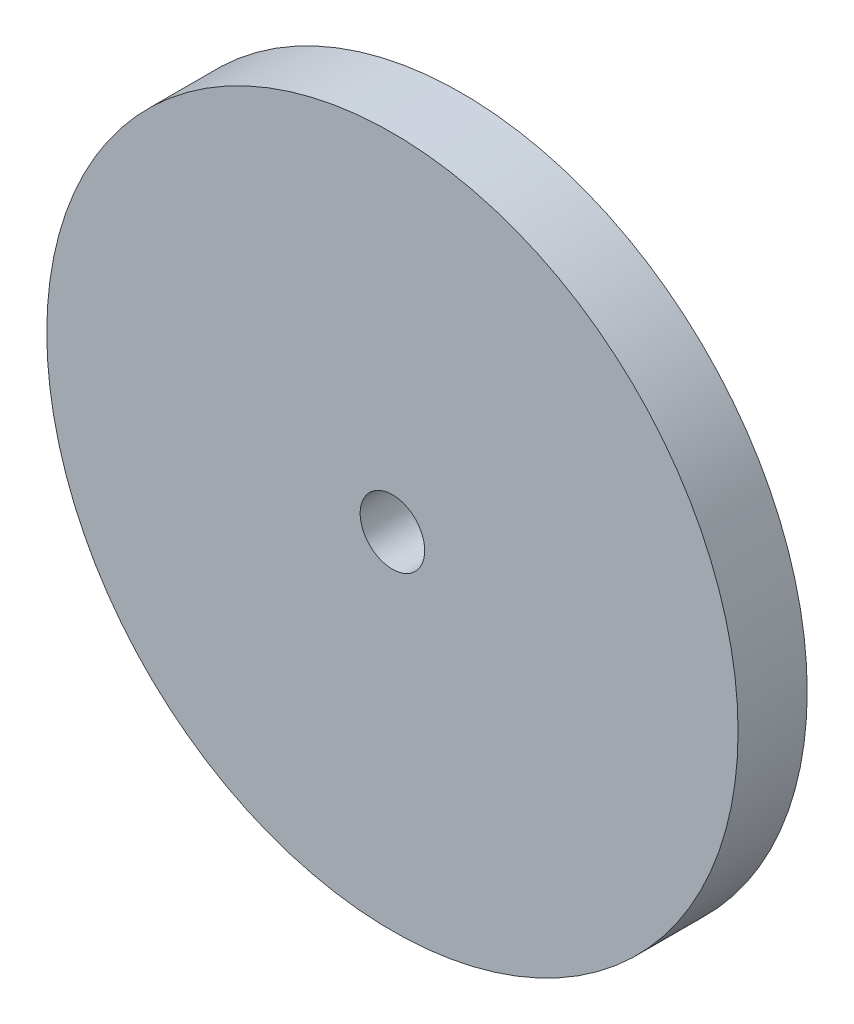
ISO-10303-21;
HEADER;
FILE_DESCRIPTION(('STEP AP214'),'2;1');
FILE_NAME('part.step','',(''),(''),'','','');
FILE_SCHEMA(('AUTOMOTIVE_DESIGN { 1 0 10303 214 1 1 1 1 }'));
ENDSEC;
DATA;
#1=APPLICATION_CONTEXT('core data for automotive mechanical design processes');
#2=APPLICATION_PROTOCOL_DEFINITION('international standard','automotive_design',2000,#1);
#3=PRODUCT_CONTEXT('',#1,'mechanical');
#4=PRODUCT('Part','Part','',(#3));
#5=PRODUCT_RELATED_PRODUCT_CATEGORY('part','',(#4));
#6=PRODUCT_DEFINITION_FORMATION('','',#4);
#7=PRODUCT_DEFINITION_CONTEXT('part definition',#1,'design');
#8=PRODUCT_DEFINITION('design','',#6,#7);
#9=PRODUCT_DEFINITION_SHAPE('','',#8);
#10=(LENGTH_UNIT() NAMED_UNIT(*) SI_UNIT(.MILLI.,.METRE.));
#11=(NAMED_UNIT(*) PLANE_ANGLE_UNIT() SI_UNIT($,.RADIAN.));
#12=(NAMED_UNIT(*) SI_UNIT($,.STERADIAN.) SOLID_ANGLE_UNIT());
#13=UNCERTAINTY_MEASURE_WITH_UNIT(LENGTH_MEASURE(1.E-05),#10,'distance_accuracy_value','');
#14=(GEOMETRIC_REPRESENTATION_CONTEXT(3) GLOBAL_UNCERTAINTY_ASSIGNED_CONTEXT((#13)) GLOBAL_UNIT_ASSIGNED_CONTEXT((#10,
#11,#12)) REPRESENTATION_CONTEXT('',''));
#15=CARTESIAN_POINT('',(0.,0.,0.));
#16=DIRECTION('',(0.,0.,1.));
#17=DIRECTION('',(1.,0.,0.));
#18=AXIS2_PLACEMENT_3D('',#15,#16,#17);
#19=CARTESIAN_POINT('',(0.,0.,3.));
#20=DIRECTION('',(0.,0.,1.));
#21=DIRECTION('',(1.,0.,0.));
#22=AXIS2_PLACEMENT_3D('',#19,#20,#21);
#23=PLANE('',#22);
#24=CARTESIAN_POINT('',(0.,0.,3.));
#25=DIRECTION('',(0.,0.,1.));
#26=DIRECTION('',(1.,0.,0.));
#27=AXIS2_PLACEMENT_3D('',#24,#25,#26);
#28=CIRCLE('',#27,15.);
#29=CARTESIAN_POINT('',(15.,0.,3.));
#30=VERTEX_POINT('',#29);
#31=EDGE_CURVE('E10',#30,#30,#28,.T.);
#32=ORIENTED_EDGE('',*,*,#31,.T.);
#33=EDGE_LOOP('',(#32));
#34=FACE_BOUND('',#33,.T.);
#35=CARTESIAN_POINT('',(0.,0.,3.));
#36=DIRECTION('',(0.,0.,1.));
#37=DIRECTION('',(1.,0.,0.));
#38=AXIS2_PLACEMENT_3D('',#35,#36,#37);
#39=CIRCLE('',#38,1.4);
#40=CARTESIAN_POINT('',(1.4,0.,3.));
#41=VERTEX_POINT('',#40);
#42=EDGE_CURVE('E39',#41,#41,#39,.T.);
#43=ORIENTED_EDGE('',*,*,#42,.F.);
#44=EDGE_LOOP('',(#43));
#45=FACE_BOUND('',#44,.T.);
#46=ADVANCED_FACE('F28',(#34,#45),#23,.T.);
#47=CARTESIAN_POINT('',(0.,0.,0.));
#48=DIRECTION('',(0.,0.,1.));
#49=DIRECTION('',(1.,0.,0.));
#50=AXIS2_PLACEMENT_3D('',#47,#48,#49);
#51=PLANE('',#50);
#52=CARTESIAN_POINT('',(0.,0.,0.));
#53=DIRECTION('',(0.,0.,1.));
#54=DIRECTION('',(1.,0.,0.));
#55=AXIS2_PLACEMENT_3D('',#52,#53,#54);
#56=CIRCLE('',#55,15.);
#57=CARTESIAN_POINT('',(15.,0.,0.));
#58=VERTEX_POINT('',#57);
#59=EDGE_CURVE('E32',#58,#58,#56,.T.);
#60=ORIENTED_EDGE('',*,*,#59,.F.);
#61=EDGE_LOOP('',(#60));
#62=FACE_BOUND('',#61,.T.);
#63=CARTESIAN_POINT('',(0.,0.,0.));
#64=DIRECTION('',(0.,0.,1.));
#65=DIRECTION('',(1.,0.,0.));
#66=AXIS2_PLACEMENT_3D('',#63,#64,#65);
#67=CIRCLE('',#66,1.4);
#68=CARTESIAN_POINT('',(1.4,0.,0.));
#69=VERTEX_POINT('',#68);
#70=EDGE_CURVE('E41',#69,#69,#67,.T.);
#71=ORIENTED_EDGE('',*,*,#70,.T.);
#72=EDGE_LOOP('',(#71));
#73=FACE_BOUND('',#72,.T.);
#74=ADVANCED_FACE('F51',(#62,#73),#51,.F.);
#75=CARTESIAN_POINT('',(0.,0.,3.));
#76=DIRECTION('',(0.,0.,-1.));
#77=DIRECTION('',(-1.,0.,0.));
#78=AXIS2_PLACEMENT_3D('',#75,#76,#77);
#79=CYLINDRICAL_SURFACE('',#78,15.);
#80=ORIENTED_EDGE('',*,*,#31,.F.);
#81=EDGE_LOOP('',(#80));
#82=FACE_BOUND('',#81,.T.);
#83=ORIENTED_EDGE('',*,*,#59,.T.);
#84=EDGE_LOOP('',(#83));
#85=FACE_BOUND('',#84,.T.);
#86=ADVANCED_FACE('F30',(#82,#85),#79,.T.);
#87=CARTESIAN_POINT('',(0.,0.,3.));
#88=DIRECTION('',(0.,0.,-1.));
#89=DIRECTION('',(-1.,0.,0.));
#90=AXIS2_PLACEMENT_3D('',#87,#88,#89);
#91=CYLINDRICAL_SURFACE('',#90,1.4);
#92=ORIENTED_EDGE('',*,*,#42,.T.);
#93=EDGE_LOOP('',(#92));
#94=FACE_BOUND('',#93,.T.);
#95=ORIENTED_EDGE('',*,*,#70,.F.);
#96=EDGE_LOOP('',(#95));
#97=FACE_BOUND('',#96,.T.);
#98=ADVANCED_FACE('F47',(#94,#97),#91,.F.);
#99=CLOSED_SHELL('',(#46,#74,#86,#98));
#100=MANIFOLD_SOLID_BREP('B2',#99);
#101=ADVANCED_BREP_SHAPE_REPRESENTATION('',(#18,#100),#14);
#102=SHAPE_DEFINITION_REPRESENTATION(#9,#101);
ENDSEC;
END-ISO-10303-21;
